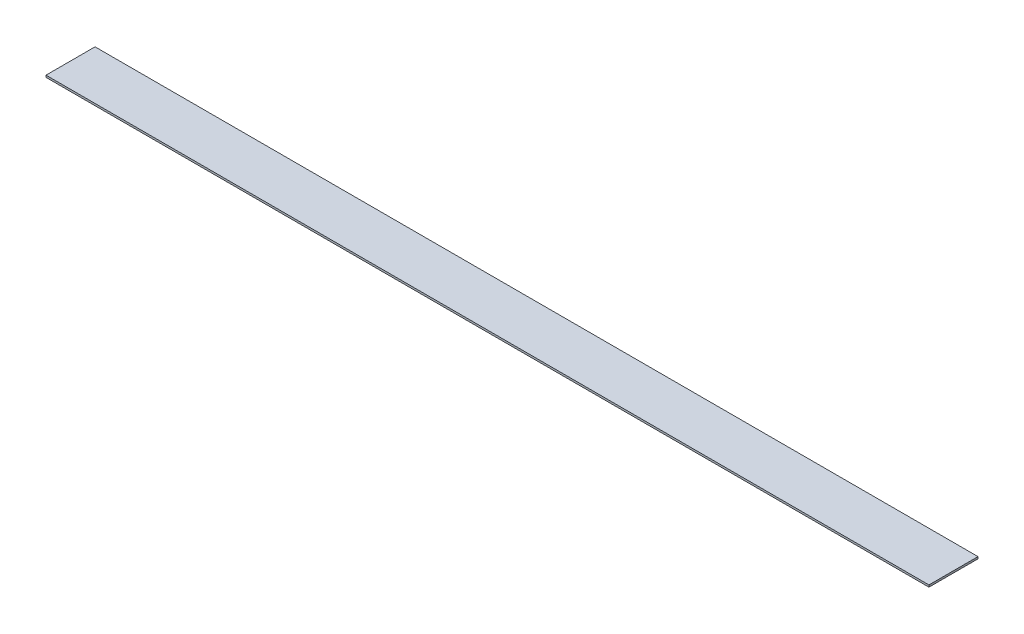
ISO-10303-21;
HEADER;
FILE_DESCRIPTION(('STEP AP214'),'2;1');
FILE_NAME('part.step','',(''),(''),'','','');
FILE_SCHEMA(('AUTOMOTIVE_DESIGN { 1 0 10303 214 1 1 1 1 }'));
ENDSEC;
DATA;
#1=APPLICATION_CONTEXT('core data for automotive mechanical design processes');
#2=APPLICATION_PROTOCOL_DEFINITION('international standard','automotive_design',2000,#1);
#3=PRODUCT_CONTEXT('',#1,'mechanical');
#4=PRODUCT('Part','Part','',(#3));
#5=PRODUCT_RELATED_PRODUCT_CATEGORY('part','',(#4));
#6=PRODUCT_DEFINITION_FORMATION('','',#4);
#7=PRODUCT_DEFINITION_CONTEXT('part definition',#1,'design');
#8=PRODUCT_DEFINITION('design','',#6,#7);
#9=PRODUCT_DEFINITION_SHAPE('','',#8);
#10=(LENGTH_UNIT() NAMED_UNIT(*) SI_UNIT(.MILLI.,.METRE.));
#11=(NAMED_UNIT(*) PLANE_ANGLE_UNIT() SI_UNIT($,.RADIAN.));
#12=(NAMED_UNIT(*) SI_UNIT($,.STERADIAN.) SOLID_ANGLE_UNIT());
#13=UNCERTAINTY_MEASURE_WITH_UNIT(LENGTH_MEASURE(1.E-05),#10,'distance_accuracy_value','');
#14=(GEOMETRIC_REPRESENTATION_CONTEXT(3) GLOBAL_UNCERTAINTY_ASSIGNED_CONTEXT((#13)) GLOBAL_UNIT_ASSIGNED_CONTEXT((#10,
#11,#12)) REPRESENTATION_CONTEXT('',''));
#15=CARTESIAN_POINT('',(0.,0.,0.));
#16=DIRECTION('',(0.,0.,1.));
#17=DIRECTION('',(1.,0.,0.));
#18=AXIS2_PLACEMENT_3D('',#15,#16,#17);
#19=CARTESIAN_POINT('',(225.,1.,-12.5));
#20=DIRECTION('',(-1.,0.,0.));
#21=DIRECTION('',(0.,0.,1.));
#22=AXIS2_PLACEMENT_3D('',#19,#20,#21);
#23=PLANE('',#22);
#24=DIRECTION('',(0.,0.,-1.));
#25=VECTOR('',#24,1.);
#26=CARTESIAN_POINT('',(225.,0.,-12.5));
#27=LINE('',#26,#25);
#28=CARTESIAN_POINT('',(225.,0.,12.5));
#29=VERTEX_POINT('',#28);
#30=CARTESIAN_POINT('',(225.,0.,-12.5));
#31=VERTEX_POINT('',#30);
#32=EDGE_CURVE('E95',#29,#31,#27,.T.);
#33=ORIENTED_EDGE('',*,*,#32,.T.);
#34=DIRECTION('',(0.,-1.,0.));
#35=VECTOR('',#34,1.);
#36=CARTESIAN_POINT('',(225.,1.,-12.5));
#37=LINE('',#36,#35);
#38=CARTESIAN_POINT('',(225.,1.,-12.5));
#39=VERTEX_POINT('',#38);
#40=EDGE_CURVE('E11',#39,#31,#37,.T.);
#41=ORIENTED_EDGE('',*,*,#40,.F.);
#42=DIRECTION('',(0.,0.,-1.));
#43=VECTOR('',#42,1.);
#44=CARTESIAN_POINT('',(225.,1.,-12.5));
#45=LINE('',#44,#43);
#46=CARTESIAN_POINT('',(225.,1.,12.5));
#47=VERTEX_POINT('',#46);
#48=EDGE_CURVE('E83',#47,#39,#45,.T.);
#49=ORIENTED_EDGE('',*,*,#48,.F.);
#50=DIRECTION('',(0.,-1.,0.));
#51=VECTOR('',#50,1.);
#52=CARTESIAN_POINT('',(225.,1.,12.5));
#53=LINE('',#52,#51);
#54=EDGE_CURVE('E91',#47,#29,#53,.T.);
#55=ORIENTED_EDGE('',*,*,#54,.T.);
#56=EDGE_LOOP('',(#33,#41,#49,#55));
#57=FACE_BOUND('',#56,.T.);
#58=ADVANCED_FACE('F32',(#57),#23,.F.);
#59=CARTESIAN_POINT('',(-225.,1.,-12.5));
#60=DIRECTION('',(0.,0.,1.));
#61=DIRECTION('',(1.,0.,0.));
#62=AXIS2_PLACEMENT_3D('',#59,#60,#61);
#63=PLANE('',#62);
#64=DIRECTION('',(-1.,0.,0.));
#65=VECTOR('',#64,1.);
#66=CARTESIAN_POINT('',(-225.,0.,-12.5));
#67=LINE('',#66,#65);
#68=CARTESIAN_POINT('',(-225.,0.,-12.5));
#69=VERTEX_POINT('',#68);
#70=EDGE_CURVE('E87',#31,#69,#67,.T.);
#71=ORIENTED_EDGE('',*,*,#70,.T.);
#72=DIRECTION('',(0.,-1.,0.));
#73=VECTOR('',#72,1.);
#74=CARTESIAN_POINT('',(-225.,1.,-12.5));
#75=LINE('',#74,#73);
#76=CARTESIAN_POINT('',(-225.,1.,-12.5));
#77=VERTEX_POINT('',#76);
#78=EDGE_CURVE('E40',#77,#69,#75,.T.);
#79=ORIENTED_EDGE('',*,*,#78,.F.);
#80=DIRECTION('',(-1.,0.,0.));
#81=VECTOR('',#80,1.);
#82=CARTESIAN_POINT('',(-225.,1.,-12.5));
#83=LINE('',#82,#81);
#84=EDGE_CURVE('E78',#39,#77,#83,.T.);
#85=ORIENTED_EDGE('',*,*,#84,.F.);
#86=ORIENTED_EDGE('',*,*,#40,.T.);
#87=EDGE_LOOP('',(#71,#79,#85,#86));
#88=FACE_BOUND('',#87,.T.);
#89=ADVANCED_FACE('F86',(#88),#63,.F.);
#90=CARTESIAN_POINT('',(-225.,1.,-12.5));
#91=DIRECTION('',(1.,0.,0.));
#92=DIRECTION('',(0.,0.,-1.));
#93=AXIS2_PLACEMENT_3D('',#90,#91,#92);
#94=PLANE('',#93);
#95=DIRECTION('',(0.,0.,1.));
#96=VECTOR('',#95,1.);
#97=CARTESIAN_POINT('',(-225.,0.,-12.5));
#98=LINE('',#97,#96);
#99=CARTESIAN_POINT('',(-225.,0.,12.5));
#100=VERTEX_POINT('',#99);
#101=EDGE_CURVE('E65',#69,#100,#98,.T.);
#102=ORIENTED_EDGE('',*,*,#101,.T.);
#103=DIRECTION('',(0.,-1.,0.));
#104=VECTOR('',#103,1.);
#105=CARTESIAN_POINT('',(-225.,1.,12.5));
#106=LINE('',#105,#104);
#107=CARTESIAN_POINT('',(-225.,1.,12.5));
#108=VERTEX_POINT('',#107);
#109=EDGE_CURVE('E88',#108,#100,#106,.T.);
#110=ORIENTED_EDGE('',*,*,#109,.F.);
#111=DIRECTION('',(0.,0.,1.));
#112=VECTOR('',#111,1.);
#113=CARTESIAN_POINT('',(-225.,1.,-12.5));
#114=LINE('',#113,#112);
#115=EDGE_CURVE('E81',#77,#108,#114,.T.);
#116=ORIENTED_EDGE('',*,*,#115,.F.);
#117=ORIENTED_EDGE('',*,*,#78,.T.);
#118=EDGE_LOOP('',(#102,#110,#116,#117));
#119=FACE_BOUND('',#118,.T.);
#120=ADVANCED_FACE('F89',(#119),#94,.F.);
#121=CARTESIAN_POINT('',(-225.,1.,12.5));
#122=DIRECTION('',(0.,0.,-1.));
#123=DIRECTION('',(-1.,0.,0.));
#124=AXIS2_PLACEMENT_3D('',#121,#122,#123);
#125=PLANE('',#124);
#126=DIRECTION('',(1.,0.,0.));
#127=VECTOR('',#126,1.);
#128=CARTESIAN_POINT('',(-225.,0.,12.5));
#129=LINE('',#128,#127);
#130=EDGE_CURVE('E71',#100,#29,#129,.T.);
#131=ORIENTED_EDGE('',*,*,#130,.T.);
#132=ORIENTED_EDGE('',*,*,#54,.F.);
#133=DIRECTION('',(1.,0.,0.));
#134=VECTOR('',#133,1.);
#135=CARTESIAN_POINT('',(-225.,1.,12.5));
#136=LINE('',#135,#134);
#137=EDGE_CURVE('E48',#108,#47,#136,.T.);
#138=ORIENTED_EDGE('',*,*,#137,.F.);
#139=ORIENTED_EDGE('',*,*,#109,.T.);
#140=EDGE_LOOP('',(#131,#132,#138,#139));
#141=FACE_BOUND('',#140,.T.);
#142=ADVANCED_FACE('F102',(#141),#125,.F.);
#143=CARTESIAN_POINT('',(0.,1.,0.));
#144=DIRECTION('',(0.,1.,0.));
#145=DIRECTION('',(0.,0.,1.));
#146=AXIS2_PLACEMENT_3D('',#143,#144,#145);
#147=PLANE('',#146);
#148=ORIENTED_EDGE('',*,*,#48,.T.);
#149=ORIENTED_EDGE('',*,*,#84,.T.);
#150=ORIENTED_EDGE('',*,*,#115,.T.);
#151=ORIENTED_EDGE('',*,*,#137,.T.);
#152=EDGE_LOOP('',(#148,#149,#150,#151));
#153=FACE_BOUND('',#152,.T.);
#154=ADVANCED_FACE('F79',(#153),#147,.T.);
#155=CARTESIAN_POINT('',(0.,0.,0.));
#156=DIRECTION('',(0.,1.,0.));
#157=DIRECTION('',(0.,0.,1.));
#158=AXIS2_PLACEMENT_3D('',#155,#156,#157);
#159=PLANE('',#158);
#160=ORIENTED_EDGE('',*,*,#32,.F.);
#161=ORIENTED_EDGE('',*,*,#130,.F.);
#162=ORIENTED_EDGE('',*,*,#101,.F.);
#163=ORIENTED_EDGE('',*,*,#70,.F.);
#164=EDGE_LOOP('',(#160,#161,#162,#163));
#165=FACE_BOUND('',#164,.T.);
#166=ADVANCED_FACE('F105',(#165),#159,.F.);
#167=CLOSED_SHELL('',(#58,#89,#120,#142,#154,#166));
#168=MANIFOLD_SOLID_BREP('B2',#167);
#169=ADVANCED_BREP_SHAPE_REPRESENTATION('',(#18,#168),#14);
#170=SHAPE_DEFINITION_REPRESENTATION(#9,#169);
ENDSEC;
END-ISO-10303-21;
